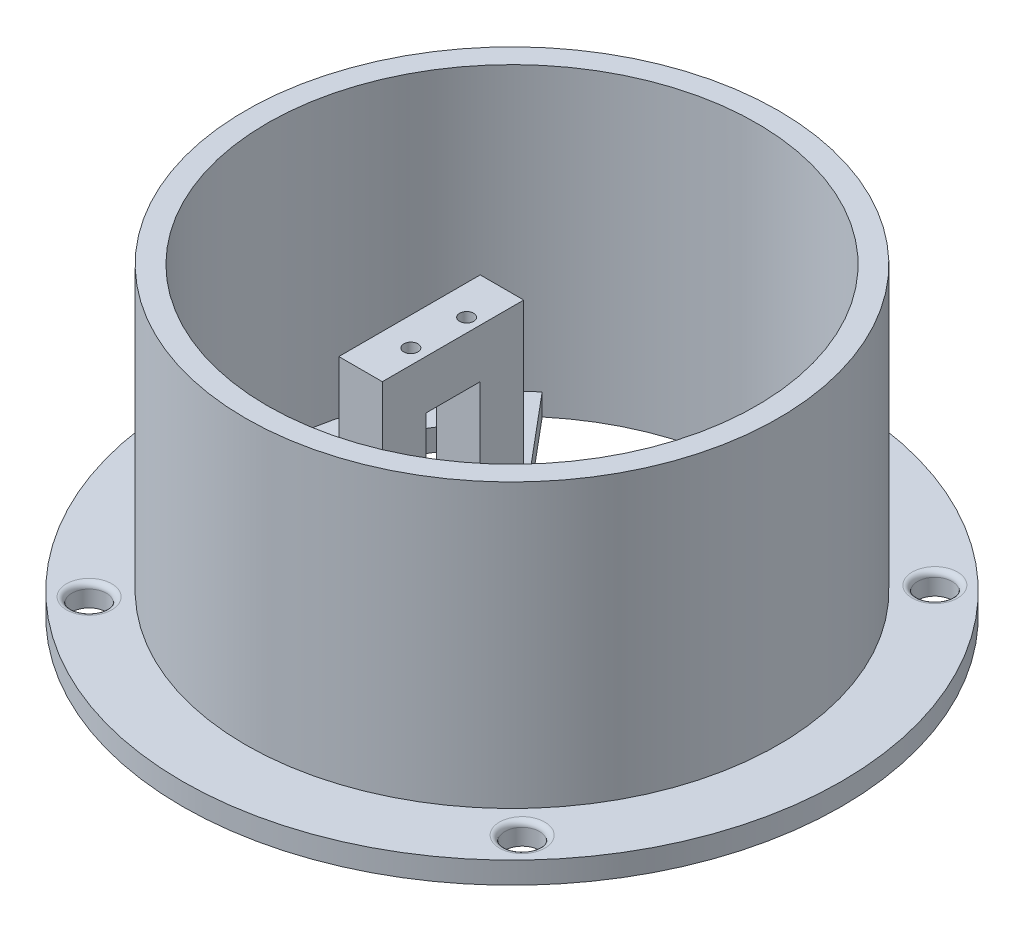
ISO-10303-21;
HEADER;
FILE_DESCRIPTION(('STEP AP214'),'2;1');
FILE_NAME('part.step','',(''),(''),'','','');
FILE_SCHEMA(('AUTOMOTIVE_DESIGN { 1 0 10303 214 1 1 1 1 }'));
ENDSEC;
DATA;
#1=APPLICATION_CONTEXT('core data for automotive mechanical design processes');
#2=APPLICATION_PROTOCOL_DEFINITION('international standard','automotive_design',2000,#1);
#3=PRODUCT_CONTEXT('',#1,'mechanical');
#4=PRODUCT('Part','Part','',(#3));
#5=PRODUCT_RELATED_PRODUCT_CATEGORY('part','',(#4));
#6=PRODUCT_DEFINITION_FORMATION('','',#4);
#7=PRODUCT_DEFINITION_CONTEXT('part definition',#1,'design');
#8=PRODUCT_DEFINITION('design','',#6,#7);
#9=PRODUCT_DEFINITION_SHAPE('','',#8);
#10=(LENGTH_UNIT() NAMED_UNIT(*) SI_UNIT(.MILLI.,.METRE.));
#11=(NAMED_UNIT(*) PLANE_ANGLE_UNIT() SI_UNIT($,.RADIAN.));
#12=(NAMED_UNIT(*) SI_UNIT($,.STERADIAN.) SOLID_ANGLE_UNIT());
#13=UNCERTAINTY_MEASURE_WITH_UNIT(LENGTH_MEASURE(1.E-05),#10,'distance_accuracy_value','');
#14=(GEOMETRIC_REPRESENTATION_CONTEXT(3) GLOBAL_UNCERTAINTY_ASSIGNED_CONTEXT((#13)) GLOBAL_UNIT_ASSIGNED_CONTEXT((#10,
#11,#12)) REPRESENTATION_CONTEXT('',''));
#15=CARTESIAN_POINT('',(0.,0.,0.));
#16=DIRECTION('',(0.,0.,1.));
#17=DIRECTION('',(1.,0.,0.));
#18=AXIS2_PLACEMENT_3D('',#15,#16,#17);
#19=CARTESIAN_POINT('',(0.,56.,0.));
#20=DIRECTION('',(0.,-1.,0.));
#21=DIRECTION('',(0.,0.,-1.));
#22=AXIS2_PLACEMENT_3D('',#19,#20,#21);
#23=CYLINDRICAL_SURFACE('',#22,45.);
#24=CARTESIAN_POINT('',(0.,56.,0.));
#25=DIRECTION('',(0.,1.,0.));
#26=DIRECTION('',(0.,0.,1.));
#27=AXIS2_PLACEMENT_3D('',#24,#25,#26);
#28=CIRCLE('',#27,45.);
#29=CARTESIAN_POINT('',(0.,56.,45.));
#30=VERTEX_POINT('',#29);
#31=EDGE_CURVE('E238',#30,#30,#28,.T.);
#32=ORIENTED_EDGE('',*,*,#31,.T.);
#33=EDGE_LOOP('',(#32));
#34=FACE_BOUND('',#33,.T.);
#35=CARTESIAN_POINT('',(0.,0.,0.));
#36=DIRECTION('',(0.,1.,0.));
#37=DIRECTION('',(0.,0.,1.));
#38=AXIS2_PLACEMENT_3D('',#35,#36,#37);
#39=CIRCLE('',#38,45.);
#40=CARTESIAN_POINT('',(42.9563294473592,0.,-13.4072279166849));
#41=VERTEX_POINT('',#40);
#42=CARTESIAN_POINT('',(-28.9254424358942,0.,-34.4719999403541));
#43=VERTEX_POINT('',#42);
#44=EDGE_CURVE('E237',#41,#43,#39,.T.);
#45=ORIENTED_EDGE('',*,*,#44,.F.);
#46=DIRECTION('',(0.,-1.,0.));
#47=VECTOR('',#46,1.);
#48=CARTESIAN_POINT('',(42.9563294473592,56.,-13.4072279166849));
#49=LINE('',#48,#47);
#50=CARTESIAN_POINT('',(42.9563294473592,38.,-13.4072279166849));
#51=VERTEX_POINT('',#50);
#52=EDGE_CURVE('E392',#41,#51,#49,.F.);
#53=ORIENTED_EDGE('',*,*,#52,.T.);
#54=CARTESIAN_POINT('',(0.,38.,0.));
#55=DIRECTION('',(0.,1.,0.));
#56=DIRECTION('',(0.,0.,1.));
#57=AXIS2_PLACEMENT_3D('',#54,#55,#56);
#58=CIRCLE('',#57,45.);
#59=CARTESIAN_POINT('',(43.1948052996357,38.,12.6177967619772));
#60=VERTEX_POINT('',#59);
#61=EDGE_CURVE('E385',#60,#51,#58,.T.);
#62=ORIENTED_EDGE('',*,*,#61,.F.);
#63=DIRECTION('',(0.,-1.,0.));
#64=VECTOR('',#63,1.);
#65=CARTESIAN_POINT('',(43.1948052996357,56.,12.6177967619772));
#66=LINE('',#65,#64);
#67=CARTESIAN_POINT('',(43.1948052996357,0.,12.6177967619772));
#68=VERTEX_POINT('',#67);
#69=EDGE_CURVE('E388',#60,#68,#66,.T.);
#70=ORIENTED_EDGE('',*,*,#69,.T.);
#71=CARTESIAN_POINT('',(-29.3245261095099,0.,34.1331535087614));
#72=VERTEX_POINT('',#71);
#73=EDGE_CURVE('E243',#72,#68,#39,.T.);
#74=ORIENTED_EDGE('',*,*,#73,.F.);
#75=DIRECTION('',(0.,-1.,0.));
#76=VECTOR('',#75,1.);
#77=CARTESIAN_POINT('',(-29.3245261095099,4.,34.1331535087614));
#78=LINE('',#77,#76);
#79=CARTESIAN_POINT('',(-29.3245261095099,4.,34.1331535087614));
#80=VERTEX_POINT('',#79);
#81=EDGE_CURVE('E377',#80,#72,#78,.T.);
#82=ORIENTED_EDGE('',*,*,#81,.F.);
#83=CARTESIAN_POINT('',(0.,4.,0.));
#84=DIRECTION('',(0.,1.,0.));
#85=DIRECTION('',(0.,0.,1.));
#86=AXIS2_PLACEMENT_3D('',#83,#84,#85);
#87=CIRCLE('',#86,45.);
#88=CARTESIAN_POINT('',(-28.9254424358942,4.,-34.4719999403541));
#89=VERTEX_POINT('',#88);
#90=EDGE_CURVE('E354',#89,#80,#87,.T.);
#91=ORIENTED_EDGE('',*,*,#90,.F.);
#92=DIRECTION('',(0.,-1.,0.));
#93=VECTOR('',#92,1.);
#94=CARTESIAN_POINT('',(-28.9254424358942,4.,-34.4719999403541));
#95=LINE('',#94,#93);
#96=EDGE_CURVE('E381',#89,#43,#95,.T.);
#97=ORIENTED_EDGE('',*,*,#96,.T.);
#98=EDGE_LOOP('',(#45,#53,#62,#70,#74,#82,#91,#97));
#99=FACE_BOUND('',#98,.T.);
#100=ADVANCED_FACE('F43',(#34,#99),#23,.F.);
#101=CARTESIAN_POINT('',(-11.25,4.,-13.4072279166849));
#102=DIRECTION('',(-0.766044443118979,0.,0.642787609686538));
#103=DIRECTION('',(0.642787609686538,0.,0.766044443118979));
#104=AXIS2_PLACEMENT_3D('',#101,#102,#103);
#105=PLANE('',#104);
#106=DIRECTION('',(-0.642787609686538,0.,-0.766044443118979));
#107=VECTOR('',#106,1.);
#108=CARTESIAN_POINT('',(-11.25,0.,-13.4072279166849));
#109=LINE('',#108,#107);
#110=CARTESIAN_POINT('',(-11.25,0.,-13.4072279166849));
#111=VERTEX_POINT('',#110);
#112=EDGE_CURVE('E350',#111,#43,#109,.T.);
#113=ORIENTED_EDGE('',*,*,#112,.T.);
#114=ORIENTED_EDGE('',*,*,#96,.F.);
#115=DIRECTION('',(-0.642787609686538,0.,-0.766044443118979));
#116=VECTOR('',#115,1.);
#117=CARTESIAN_POINT('',(-11.25,4.,-13.4072279166849));
#118=LINE('',#117,#116);
#119=CARTESIAN_POINT('',(-11.25,4.,-13.4072279166849));
#120=VERTEX_POINT('',#119);
#121=EDGE_CURVE('E351',#120,#89,#118,.T.);
#122=ORIENTED_EDGE('',*,*,#121,.F.);
#123=DIRECTION('',(0.,-1.,0.));
#124=VECTOR('',#123,1.);
#125=CARTESIAN_POINT('',(-11.25,4.,-13.4072279166849));
#126=LINE('',#125,#124);
#127=EDGE_CURVE('E361',#120,#111,#126,.T.);
#128=ORIENTED_EDGE('',*,*,#127,.T.);
#129=EDGE_LOOP('',(#113,#114,#122,#128));
#130=FACE_BOUND('',#129,.T.);
#131=ADVANCED_FACE('F552',(#130),#105,.F.);
#132=CARTESIAN_POINT('',(-11.25,4.,12.5927720833151));
#133=DIRECTION('',(-0.766044443118979,0.,-0.642787609686538));
#134=DIRECTION('',(-0.642787609686538,0.,0.766044443118979));
#135=AXIS2_PLACEMENT_3D('',#132,#133,#134);
#136=PLANE('',#135);
#137=DIRECTION('',(0.642787609686538,0.,-0.766044443118979));
#138=VECTOR('',#137,1.);
#139=CARTESIAN_POINT('',(-11.25,0.,12.5927720833151));
#140=LINE('',#139,#138);
#141=CARTESIAN_POINT('',(-11.25,0.,12.5927720833151));
#142=VERTEX_POINT('',#141);
#143=EDGE_CURVE('E365',#72,#142,#140,.T.);
#144=ORIENTED_EDGE('',*,*,#143,.T.);
#145=DIRECTION('',(0.,-1.,0.));
#146=VECTOR('',#145,1.);
#147=CARTESIAN_POINT('',(-11.25,4.,12.5927720833151));
#148=LINE('',#147,#146);
#149=CARTESIAN_POINT('',(-11.25,4.,12.5927720833151));
#150=VERTEX_POINT('',#149);
#151=EDGE_CURVE('E373',#150,#142,#148,.T.);
#152=ORIENTED_EDGE('',*,*,#151,.F.);
#153=DIRECTION('',(0.642787609686538,0.,-0.766044443118979));
#154=VECTOR('',#153,1.);
#155=CARTESIAN_POINT('',(-11.25,4.,12.5927720833151));
#156=LINE('',#155,#154);
#157=EDGE_CURVE('E358',#80,#150,#156,.T.);
#158=ORIENTED_EDGE('',*,*,#157,.F.);
#159=ORIENTED_EDGE('',*,*,#81,.T.);
#160=EDGE_LOOP('',(#144,#152,#158,#159));
#161=FACE_BOUND('',#160,.T.);
#162=ADVANCED_FACE('F546',(#161),#136,.F.);
#163=CARTESIAN_POINT('',(-11.25,4.,-13.4072279166849));
#164=DIRECTION('',(-1.,0.,0.));
#165=DIRECTION('',(0.,0.,1.));
#166=AXIS2_PLACEMENT_3D('',#163,#164,#165);
#167=PLANE('',#166);
#168=DIRECTION('',(0.,0.,1.));
#169=VECTOR('',#168,1.);
#170=CARTESIAN_POINT('',(-11.25,29.,4.59277208331509));
#171=LINE('',#170,#169);
#172=CARTESIAN_POINT('',(-11.25,29.,-5.40722791668491));
#173=VERTEX_POINT('',#172);
#174=CARTESIAN_POINT('',(-11.25,29.,4.59277208331509));
#175=VERTEX_POINT('',#174);
#176=EDGE_CURVE('E280',#173,#175,#171,.T.);
#177=ORIENTED_EDGE('',*,*,#176,.F.);
#178=DIRECTION('',(0.,1.,0.));
#179=VECTOR('',#178,1.);
#180=CARTESIAN_POINT('',(-11.25,29.,-5.40722791668491));
#181=LINE('',#180,#179);
#182=CARTESIAN_POINT('',(-11.25,5.,-5.40722791668491));
#183=VERTEX_POINT('',#182);
#184=EDGE_CURVE('E277',#183,#173,#181,.T.);
#185=ORIENTED_EDGE('',*,*,#184,.F.);
#186=DIRECTION('',(0.,0.,-1.));
#187=VECTOR('',#186,1.);
#188=CARTESIAN_POINT('',(-11.25,5.,4.59277208331509));
#189=LINE('',#188,#187);
#190=CARTESIAN_POINT('',(-11.25,5.,4.59277208331509));
#191=VERTEX_POINT('',#190);
#192=EDGE_CURVE('E288',#191,#183,#189,.T.);
#193=ORIENTED_EDGE('',*,*,#192,.F.);
#194=DIRECTION('',(0.,-1.,0.));
#195=VECTOR('',#194,1.);
#196=CARTESIAN_POINT('',(-11.25,29.,4.59277208331509));
#197=LINE('',#196,#195);
#198=EDGE_CURVE('E284',#175,#191,#197,.T.);
#199=ORIENTED_EDGE('',*,*,#198,.F.);
#200=EDGE_LOOP('',(#177,#185,#193,#199));
#201=FACE_BOUND('',#200,.T.);
#202=DIRECTION('',(0.,0.,-1.));
#203=VECTOR('',#202,1.);
#204=CARTESIAN_POINT('',(-11.25,0.,-13.4072279166849));
#205=LINE('',#204,#203);
#206=EDGE_CURVE('E355',#142,#111,#205,.T.);
#207=ORIENTED_EDGE('',*,*,#206,.T.);
#208=ORIENTED_EDGE('',*,*,#127,.F.);
#209=DIRECTION('',(0.,-1.,0.));
#210=VECTOR('',#209,1.);
#211=CARTESIAN_POINT('',(-11.25,38.,-13.4072279166849));
#212=LINE('',#211,#210);
#213=CARTESIAN_POINT('',(-11.25,38.,-13.4072279166849));
#214=VERTEX_POINT('',#213);
#215=EDGE_CURVE('E324',#214,#120,#212,.T.);
#216=ORIENTED_EDGE('',*,*,#215,.F.);
#217=DIRECTION('',(0.,0.,-1.));
#218=VECTOR('',#217,1.);
#219=CARTESIAN_POINT('',(-11.25,38.,-13.4072279166849));
#220=LINE('',#219,#218);
#221=CARTESIAN_POINT('',(-11.25,38.,12.5927720833151));
#222=VERTEX_POINT('',#221);
#223=EDGE_CURVE('E321',#222,#214,#220,.T.);
#224=ORIENTED_EDGE('',*,*,#223,.F.);
#225=DIRECTION('',(0.,-1.,0.));
#226=VECTOR('',#225,1.);
#227=CARTESIAN_POINT('',(-11.25,38.,12.5927720833151));
#228=LINE('',#227,#226);
#229=EDGE_CURVE('E338',#222,#150,#228,.T.);
#230=ORIENTED_EDGE('',*,*,#229,.T.);
#231=ORIENTED_EDGE('',*,*,#151,.T.);
#232=EDGE_LOOP('',(#207,#208,#216,#224,#230,#231));
#233=FACE_BOUND('',#232,.T.);
#234=ADVANCED_FACE('F556',(#201,#233),#167,.F.);
#235=CARTESIAN_POINT('',(0.,4.,0.));
#236=DIRECTION('',(0.,1.,0.));
#237=DIRECTION('',(0.,0.,1.));
#238=AXIS2_PLACEMENT_3D('',#235,#236,#237);
#239=PLANE('',#238);
#240=DIRECTION('',(-0.64064590653356,0.,-0.767836455530599));
#241=VECTOR('',#240,1.);
#242=CARTESIAN_POINT('',(-24.25,4.,-17.1368531610951));
#243=LINE('',#242,#241);
#244=CARTESIAN_POINT('',(-24.25,4.,-17.1368531610951));
#245=VERTEX_POINT('',#244);
#246=CARTESIAN_POINT('',(-29.4776705973138,4.,-23.4023986382247));
#247=VERTEX_POINT('',#246);
#248=EDGE_CURVE('E59',#245,#247,#243,.T.);
#249=ORIENTED_EDGE('',*,*,#248,.F.);
#250=DIRECTION('',(0.,0.,-1.));
#251=VECTOR('',#250,1.);
#252=CARTESIAN_POINT('',(-24.25,4.,-17.1368531610951));
#253=LINE('',#252,#251);
#254=CARTESIAN_POINT('',(-24.25,4.,15.0431468389049));
#255=VERTEX_POINT('',#254);
#256=EDGE_CURVE('E196',#255,#245,#253,.T.);
#257=ORIENTED_EDGE('',*,*,#256,.F.);
#258=DIRECTION('',(0.64064590653356,0.,-0.767836455530599));
#259=VECTOR('',#258,1.);
#260=CARTESIAN_POINT('',(-24.25,4.,15.0431468389049));
#261=LINE('',#260,#259);
#262=CARTESIAN_POINT('',(-29.4776705973138,4.,21.3086923160346));
#263=VERTEX_POINT('',#262);
#264=EDGE_CURVE('E178',#263,#255,#261,.T.);
#265=ORIENTED_EDGE('',*,*,#264,.F.);
#266=CARTESIAN_POINT('',(-7.11214499325518,4.,-1.04685316109506));
#267=DIRECTION('',(0.,1.,0.));
#268=DIRECTION('',(0.,0.,1.));
#269=AXIS2_PLACEMENT_3D('',#266,#267,#268);
#270=CIRCLE('',#269,31.6225734108693);
#271=EDGE_CURVE('E188',#247,#263,#270,.T.);
#272=ORIENTED_EDGE('',*,*,#271,.F.);
#273=EDGE_LOOP('',(#249,#257,#265,#272));
#274=FACE_BOUND('',#273,.T.);
#275=DIRECTION('',(-1.,0.,0.));
#276=VECTOR('',#275,1.);
#277=CARTESIAN_POINT('',(-19.25,4.,-13.4072279166849));
#278=LINE('',#277,#276);
#279=CARTESIAN_POINT('',(-19.25,4.,-13.4072279166849));
#280=VERTEX_POINT('',#279);
#281=EDGE_CURVE('E309',#120,#280,#278,.T.);
#282=ORIENTED_EDGE('',*,*,#281,.F.);
#283=ORIENTED_EDGE('',*,*,#121,.T.);
#284=ORIENTED_EDGE('',*,*,#90,.T.);
#285=ORIENTED_EDGE('',*,*,#157,.T.);
#286=DIRECTION('',(1.,0.,0.));
#287=VECTOR('',#286,1.);
#288=CARTESIAN_POINT('',(-11.25,4.,12.5927720833151));
#289=LINE('',#288,#287);
#290=CARTESIAN_POINT('',(-19.25,4.,12.5927720833151));
#291=VERTEX_POINT('',#290);
#292=EDGE_CURVE('E315',#291,#150,#289,.T.);
#293=ORIENTED_EDGE('',*,*,#292,.F.);
#294=DIRECTION('',(0.,0.,1.));
#295=VECTOR('',#294,1.);
#296=CARTESIAN_POINT('',(-19.25,4.,12.5927720833151));
#297=LINE('',#296,#295);
#298=EDGE_CURVE('E328',#280,#291,#297,.T.);
#299=ORIENTED_EDGE('',*,*,#298,.F.);
#300=EDGE_LOOP('',(#282,#283,#284,#285,#293,#299));
#301=FACE_BOUND('',#300,.T.);
#302=ADVANCED_FACE('F193',(#274,#301),#239,.T.);
#303=CARTESIAN_POINT('',(0.,0.,0.));
#304=DIRECTION('',(0.,1.,0.));
#305=DIRECTION('',(0.,0.,1.));
#306=AXIS2_PLACEMENT_3D('',#303,#304,#305);
#307=PLANE('',#306);
#308=CARTESIAN_POINT('',(-37.9459720978994,0.,39.8133545628278));
#309=DIRECTION('',(0.,1.,0.));
#310=DIRECTION('',(0.,0.,1.));
#311=AXIS2_PLACEMENT_3D('',#308,#309,#310);
#312=CIRCLE('',#311,3.1645);
#313=CARTESIAN_POINT('',(-37.9459720978994,0.,42.9778545628278));
#314=VERTEX_POINT('',#313);
#315=EDGE_CURVE('E476',#314,#314,#312,.T.);
#316=ORIENTED_EDGE('',*,*,#315,.T.);
#317=EDGE_LOOP('',(#316));
#318=FACE_BOUND('',#317,.T.);
#319=CARTESIAN_POINT('',(39.8140279021006,0.,37.9452656099645));
#320=DIRECTION('',(0.,1.,0.));
#321=DIRECTION('',(0.,0.,1.));
#322=AXIS2_PLACEMENT_3D('',#319,#320,#321);
#323=CIRCLE('',#322,3.1645);
#324=CARTESIAN_POINT('',(39.8140279021006,0.,41.1097656099645));
#325=VERTEX_POINT('',#324);
#326=EDGE_CURVE('E480',#325,#325,#323,.T.);
#327=ORIENTED_EDGE('',*,*,#326,.T.);
#328=EDGE_LOOP('',(#327));
#329=FACE_BOUND('',#328,.T.);
#330=CARTESIAN_POINT('',(37.9445243144637,0.,-39.8147343900355));
#331=DIRECTION('',(0.,1.,0.));
#332=DIRECTION('',(0.,0.,1.));
#333=AXIS2_PLACEMENT_3D('',#330,#331,#332);
#334=CIRCLE('',#333,3.1645);
#335=CARTESIAN_POINT('',(37.9445243144637,0.,-36.6502343900355));
#336=VERTEX_POINT('',#335);
#337=EDGE_CURVE('E470',#336,#336,#334,.T.);
#338=ORIENTED_EDGE('',*,*,#337,.T.);
#339=EDGE_LOOP('',(#338));
#340=FACE_BOUND('',#339,.T.);
#341=CARTESIAN_POINT('',(-39.8154756855363,0.,-37.9466454371722));
#342=DIRECTION('',(0.,1.,0.));
#343=DIRECTION('',(0.,0.,1.));
#344=AXIS2_PLACEMENT_3D('',#341,#342,#343);
#345=CIRCLE('',#344,3.1645);
#346=CARTESIAN_POINT('',(-39.8154756855363,0.,-34.7821454371722));
#347=VERTEX_POINT('',#346);
#348=EDGE_CURVE('E463',#347,#347,#345,.T.);
#349=ORIENTED_EDGE('',*,*,#348,.T.);
#350=EDGE_LOOP('',(#349));
#351=FACE_BOUND('',#350,.T.);
#352=DIRECTION('',(0.,0.,-1.));
#353=VECTOR('',#352,1.);
#354=CARTESIAN_POINT('',(-24.25,0.,0.));
#355=LINE('',#354,#353);
#356=CARTESIAN_POINT('',(-24.25,0.,15.0431468389049));
#357=VERTEX_POINT('',#356);
#358=CARTESIAN_POINT('',(-24.25,0.,-17.1368531610951));
#359=VERTEX_POINT('',#358);
#360=EDGE_CURVE('E401',#357,#359,#355,.T.);
#361=ORIENTED_EDGE('',*,*,#360,.T.);
#362=DIRECTION('',(-0.64064590653356,0.,-0.767836455530599));
#363=VECTOR('',#362,1.);
#364=CARTESIAN_POINT('',(-5.86732953418706,0.,4.89541831634303));
#365=LINE('',#364,#363);
#366=CARTESIAN_POINT('',(-29.4776705973138,0.,-23.4023986382247));
#367=VERTEX_POINT('',#366);
#368=EDGE_CURVE('E405',#359,#367,#365,.T.);
#369=ORIENTED_EDGE('',*,*,#368,.T.);
#370=CARTESIAN_POINT('',(-7.11214499325518,0.,-1.04685316109506));
#371=DIRECTION('',(0.,1.,0.));
#372=DIRECTION('',(0.,0.,1.));
#373=AXIS2_PLACEMENT_3D('',#370,#371,#372);
#374=CIRCLE('',#373,31.6225734108693);
#375=CARTESIAN_POINT('',(-29.4776705973138,0.,21.3086923160346));
#376=VERTEX_POINT('',#375);
#377=EDGE_CURVE('E396',#367,#376,#374,.T.);
#378=ORIENTED_EDGE('',*,*,#377,.T.);
#379=DIRECTION('',(0.64064590653356,0.,-0.767836455530599));
#380=VECTOR('',#379,1.);
#381=CARTESIAN_POINT('',(-6.89724729552448,0.,-5.7547322927953));
#382=LINE('',#381,#380);
#383=EDGE_CURVE('E181',#376,#357,#382,.T.);
#384=ORIENTED_EDGE('',*,*,#383,.T.);
#385=EDGE_LOOP('',(#361,#369,#378,#384));
#386=FACE_BOUND('',#385,.T.);
#387=ORIENTED_EDGE('',*,*,#73,.T.);
#388=DIRECTION('',(1.,0.,0.));
#389=VECTOR('',#388,1.);
#390=CARTESIAN_POINT('',(31.75,0.,12.6177967619772));
#391=LINE('',#390,#389);
#392=CARTESIAN_POINT('',(31.75,0.,12.6177967619772));
#393=VERTEX_POINT('',#392);
#394=EDGE_CURVE('E215',#393,#68,#391,.T.);
#395=ORIENTED_EDGE('',*,*,#394,.F.);
#396=DIRECTION('',(0.,0.,1.));
#397=VECTOR('',#396,1.);
#398=CARTESIAN_POINT('',(31.75,0.,-13.4072279166849));
#399=LINE('',#398,#397);
#400=CARTESIAN_POINT('',(31.75,0.,-13.4072279166849));
#401=VERTEX_POINT('',#400);
#402=EDGE_CURVE('E225',#401,#393,#399,.T.);
#403=ORIENTED_EDGE('',*,*,#402,.F.);
#404=DIRECTION('',(-1.,0.,0.));
#405=VECTOR('',#404,1.);
#406=CARTESIAN_POINT('',(31.75,0.,-13.4072279166849));
#407=LINE('',#406,#405);
#408=EDGE_CURVE('E206',#41,#401,#407,.T.);
#409=ORIENTED_EDGE('',*,*,#408,.F.);
#410=ORIENTED_EDGE('',*,*,#44,.T.);
#411=ORIENTED_EDGE('',*,*,#112,.F.);
#412=ORIENTED_EDGE('',*,*,#206,.F.);
#413=ORIENTED_EDGE('',*,*,#143,.F.);
#414=EDGE_LOOP('',(#387,#395,#403,#409,#410,#411,#412,#413));
#415=FACE_BOUND('',#414,.T.);
#416=CARTESIAN_POINT('',(0.,0.,0.));
#417=DIRECTION('',(0.,1.,0.));
#418=DIRECTION('',(0.,0.,1.));
#419=AXIS2_PLACEMENT_3D('',#416,#417,#418);
#420=CIRCLE('',#419,60.625);
#421=CARTESIAN_POINT('',(0.,0.,60.625));
#422=VERTEX_POINT('',#421);
#423=EDGE_CURVE('E462',#422,#422,#420,.T.);
#424=ORIENTED_EDGE('',*,*,#423,.F.);
#425=EDGE_LOOP('',(#424));
#426=FACE_BOUND('',#425,.T.);
#427=ADVANCED_FACE('F539',(#318,#329,#340,#351,#386,#415,#426),#307,.F.);
#428=CARTESIAN_POINT('',(-19.25,38.,-13.4072279166849));
#429=DIRECTION('',(0.,0.,1.));
#430=DIRECTION('',(1.,0.,0.));
#431=AXIS2_PLACEMENT_3D('',#428,#429,#430);
#432=PLANE('',#431);
#433=ORIENTED_EDGE('',*,*,#281,.T.);
#434=DIRECTION('',(0.,-1.,0.));
#435=VECTOR('',#434,1.);
#436=CARTESIAN_POINT('',(-19.25,38.,-13.4072279166849));
#437=LINE('',#436,#435);
#438=CARTESIAN_POINT('',(-19.25,38.,-13.4072279166849));
#439=VERTEX_POINT('',#438);
#440=EDGE_CURVE('E346',#439,#280,#437,.T.);
#441=ORIENTED_EDGE('',*,*,#440,.F.);
#442=DIRECTION('',(-1.,0.,0.));
#443=VECTOR('',#442,1.);
#444=CARTESIAN_POINT('',(-19.25,38.,-13.4072279166849));
#445=LINE('',#444,#443);
#446=EDGE_CURVE('E310',#214,#439,#445,.T.);
#447=ORIENTED_EDGE('',*,*,#446,.F.);
#448=ORIENTED_EDGE('',*,*,#215,.T.);
#449=EDGE_LOOP('',(#433,#441,#447,#448));
#450=FACE_BOUND('',#449,.T.);
#451=ADVANCED_FACE('F569',(#450),#432,.F.);
#452=CARTESIAN_POINT('',(-19.25,38.,12.5927720833151));
#453=DIRECTION('',(1.,0.,0.));
#454=DIRECTION('',(0.,0.,-1.));
#455=AXIS2_PLACEMENT_3D('',#452,#453,#454);
#456=PLANE('',#455);
#457=DIRECTION('',(0.,0.,1.));
#458=VECTOR('',#457,1.);
#459=CARTESIAN_POINT('',(-19.25,5.,4.59277208331509));
#460=LINE('',#459,#458);
#461=CARTESIAN_POINT('',(-19.25,5.,-5.40722791668491));
#462=VERTEX_POINT('',#461);
#463=CARTESIAN_POINT('',(-19.25,5.,4.59277208331509));
#464=VERTEX_POINT('',#463);
#465=EDGE_CURVE('E269',#462,#464,#460,.T.);
#466=ORIENTED_EDGE('',*,*,#465,.F.);
#467=DIRECTION('',(0.,-1.,0.));
#468=VECTOR('',#467,1.);
#469=CARTESIAN_POINT('',(-19.25,29.,-5.40722791668491));
#470=LINE('',#469,#468);
#471=CARTESIAN_POINT('',(-19.25,29.,-5.40722791668491));
#472=VERTEX_POINT('',#471);
#473=EDGE_CURVE('E273',#472,#462,#470,.T.);
#474=ORIENTED_EDGE('',*,*,#473,.F.);
#475=DIRECTION('',(0.,0.,-1.));
#476=VECTOR('',#475,1.);
#477=CARTESIAN_POINT('',(-19.25,29.,4.59277208331509));
#478=LINE('',#477,#476);
#479=CARTESIAN_POINT('',(-19.25,29.,4.59277208331509));
#480=VERTEX_POINT('',#479);
#481=EDGE_CURVE('E296',#480,#472,#478,.T.);
#482=ORIENTED_EDGE('',*,*,#481,.F.);
#483=DIRECTION('',(0.,1.,0.));
#484=VECTOR('',#483,1.);
#485=CARTESIAN_POINT('',(-19.25,29.,4.59277208331509));
#486=LINE('',#485,#484);
#487=EDGE_CURVE('E255',#464,#480,#486,.T.);
#488=ORIENTED_EDGE('',*,*,#487,.F.);
#489=EDGE_LOOP('',(#466,#474,#482,#488));
#490=FACE_BOUND('',#489,.T.);
#491=ORIENTED_EDGE('',*,*,#298,.T.);
#492=DIRECTION('',(0.,-1.,0.));
#493=VECTOR('',#492,1.);
#494=CARTESIAN_POINT('',(-19.25,38.,12.5927720833151));
#495=LINE('',#494,#493);
#496=CARTESIAN_POINT('',(-19.25,38.,12.5927720833151));
#497=VERTEX_POINT('',#496);
#498=EDGE_CURVE('E342',#497,#291,#495,.T.);
#499=ORIENTED_EDGE('',*,*,#498,.F.);
#500=DIRECTION('',(0.,0.,1.));
#501=VECTOR('',#500,1.);
#502=CARTESIAN_POINT('',(-19.25,38.,12.5927720833151));
#503=LINE('',#502,#501);
#504=EDGE_CURVE('E314',#439,#497,#503,.T.);
#505=ORIENTED_EDGE('',*,*,#504,.F.);
#506=ORIENTED_EDGE('',*,*,#440,.T.);
#507=EDGE_LOOP('',(#491,#499,#505,#506));
#508=FACE_BOUND('',#507,.T.);
#509=ADVANCED_FACE('F565',(#490,#508),#456,.F.);
#510=CARTESIAN_POINT('',(-11.25,38.,12.5927720833151));
#511=DIRECTION('',(0.,0.,-1.));
#512=DIRECTION('',(-1.,0.,0.));
#513=AXIS2_PLACEMENT_3D('',#510,#511,#512);
#514=PLANE('',#513);
#515=ORIENTED_EDGE('',*,*,#292,.T.);
#516=ORIENTED_EDGE('',*,*,#229,.F.);
#517=DIRECTION('',(1.,0.,0.));
#518=VECTOR('',#517,1.);
#519=CARTESIAN_POINT('',(-11.25,38.,12.5927720833151));
#520=LINE('',#519,#518);
#521=EDGE_CURVE('E318',#497,#222,#520,.T.);
#522=ORIENTED_EDGE('',*,*,#521,.F.);
#523=ORIENTED_EDGE('',*,*,#498,.T.);
#524=EDGE_LOOP('',(#515,#516,#522,#523));
#525=FACE_BOUND('',#524,.T.);
#526=ADVANCED_FACE('F562',(#525),#514,.F.);
#527=CARTESIAN_POINT('',(0.,38.,0.));
#528=DIRECTION('',(0.,-1.,0.));
#529=DIRECTION('',(0.,0.,-1.));
#530=AXIS2_PLACEMENT_3D('',#527,#528,#529);
#531=PLANE('',#530);
#532=CARTESIAN_POINT('',(-13.75,38.,-5.40722791668491));
#533=DIRECTION('',(0.,1.,0.));
#534=DIRECTION('',(0.,0.,1.));
#535=AXIS2_PLACEMENT_3D('',#532,#533,#534);
#536=CIRCLE('',#535,1.3);
#537=CARTESIAN_POINT('',(-13.75,38.,-4.10722791668491));
#538=VERTEX_POINT('',#537);
#539=EDGE_CURVE('E256',#538,#538,#536,.T.);
#540=ORIENTED_EDGE('',*,*,#539,.F.);
#541=EDGE_LOOP('',(#540));
#542=FACE_BOUND('',#541,.T.);
#543=CARTESIAN_POINT('',(-14.0092614160017,38.,4.59277208331509));
#544=DIRECTION('',(0.,1.,0.));
#545=DIRECTION('',(0.,0.,1.));
#546=AXIS2_PLACEMENT_3D('',#543,#544,#545);
#547=CIRCLE('',#546,1.3);
#548=CARTESIAN_POINT('',(-14.0092614160017,38.,5.89277208331509));
#549=VERTEX_POINT('',#548);
#550=EDGE_CURVE('E250',#549,#549,#547,.T.);
#551=ORIENTED_EDGE('',*,*,#550,.F.);
#552=EDGE_LOOP('',(#551));
#553=FACE_BOUND('',#552,.T.);
#554=ORIENTED_EDGE('',*,*,#446,.T.);
#555=ORIENTED_EDGE('',*,*,#504,.T.);
#556=ORIENTED_EDGE('',*,*,#521,.T.);
#557=ORIENTED_EDGE('',*,*,#223,.T.);
#558=EDGE_LOOP('',(#554,#555,#556,#557));
#559=FACE_BOUND('',#558,.T.);
#560=ADVANCED_FACE('F571',(#542,#553,#559),#531,.F.);
#561=CARTESIAN_POINT('',(-45.001,29.,-5.4072279166849));
#562=DIRECTION('',(0.,0.,-1.));
#563=DIRECTION('',(-1.,0.,0.));
#564=AXIS2_PLACEMENT_3D('',#561,#562,#563);
#565=PLANE('',#564);
#566=ORIENTED_EDGE('',*,*,#473,.T.);
#567=DIRECTION('',(1.,0.,0.));
#568=VECTOR('',#567,1.);
#569=CARTESIAN_POINT('',(-45.001,5.,-5.40722791668491));
#570=LINE('',#569,#568);
#571=EDGE_CURVE('E293',#462,#183,#570,.T.);
#572=ORIENTED_EDGE('',*,*,#571,.T.);
#573=ORIENTED_EDGE('',*,*,#184,.T.);
#574=DIRECTION('',(1.,0.,0.));
#575=VECTOR('',#574,1.);
#576=CARTESIAN_POINT('',(-45.001,29.,-5.4072279166849));
#577=LINE('',#576,#575);
#578=EDGE_CURVE('E292',#472,#173,#577,.T.);
#579=ORIENTED_EDGE('',*,*,#578,.F.);
#580=EDGE_LOOP('',(#566,#572,#573,#579));
#581=FACE_BOUND('',#580,.T.);
#582=ADVANCED_FACE('F573',(#581),#565,.F.);
#583=CARTESIAN_POINT('',(-45.001,5.,4.59277208331509));
#584=DIRECTION('',(0.,-1.,0.));
#585=DIRECTION('',(0.,0.,-1.));
#586=AXIS2_PLACEMENT_3D('',#583,#584,#585);
#587=PLANE('',#586);
#588=ORIENTED_EDGE('',*,*,#465,.T.);
#589=DIRECTION('',(1.,0.,0.));
#590=VECTOR('',#589,1.);
#591=CARTESIAN_POINT('',(-45.001,5.,4.59277208331509));
#592=LINE('',#591,#590);
#593=EDGE_CURVE('E297',#464,#191,#592,.T.);
#594=ORIENTED_EDGE('',*,*,#593,.T.);
#595=ORIENTED_EDGE('',*,*,#192,.T.);
#596=ORIENTED_EDGE('',*,*,#571,.F.);
#597=EDGE_LOOP('',(#588,#594,#595,#596));
#598=FACE_BOUND('',#597,.T.);
#599=ADVANCED_FACE('F580',(#598),#587,.F.);
#600=CARTESIAN_POINT('',(-45.001,29.,4.59277208331509));
#601=DIRECTION('',(0.,0.,1.));
#602=DIRECTION('',(1.,0.,0.));
#603=AXIS2_PLACEMENT_3D('',#600,#601,#602);
#604=PLANE('',#603);
#605=ORIENTED_EDGE('',*,*,#487,.T.);
#606=DIRECTION('',(1.,0.,0.));
#607=VECTOR('',#606,1.);
#608=CARTESIAN_POINT('',(-45.001,29.,4.59277208331509));
#609=LINE('',#608,#607);
#610=EDGE_CURVE('E300',#480,#175,#609,.T.);
#611=ORIENTED_EDGE('',*,*,#610,.T.);
#612=ORIENTED_EDGE('',*,*,#198,.T.);
#613=ORIENTED_EDGE('',*,*,#593,.F.);
#614=EDGE_LOOP('',(#605,#611,#612,#613));
#615=FACE_BOUND('',#614,.T.);
#616=ADVANCED_FACE('F621',(#615),#604,.F.);
#617=CARTESIAN_POINT('',(-45.001,29.,4.59277208331509));
#618=DIRECTION('',(0.,1.,0.));
#619=DIRECTION('',(0.,0.,1.));
#620=AXIS2_PLACEMENT_3D('',#617,#618,#619);
#621=PLANE('',#620);
#622=ORIENTED_EDGE('',*,*,#481,.T.);
#623=ORIENTED_EDGE('',*,*,#578,.T.);
#624=ORIENTED_EDGE('',*,*,#176,.T.);
#625=ORIENTED_EDGE('',*,*,#610,.F.);
#626=EDGE_LOOP('',(#622,#623,#624,#625));
#627=FACE_BOUND('',#626,.T.);
#628=ADVANCED_FACE('F617',(#627),#621,.F.);
#629=CARTESIAN_POINT('',(-14.0092614160017,31.,4.59277208331509));
#630=DIRECTION('',(0.,1.,0.));
#631=DIRECTION('',(0.,0.,1.));
#632=AXIS2_PLACEMENT_3D('',#629,#630,#631);
#633=CYLINDRICAL_SURFACE('',#632,1.3);
#634=CARTESIAN_POINT('',(-14.0092614160017,31.,4.59277208331509));
#635=DIRECTION('',(0.,1.,0.));
#636=DIRECTION('',(0.,0.,1.));
#637=AXIS2_PLACEMENT_3D('',#634,#635,#636);
#638=CIRCLE('',#637,1.3);
#639=CARTESIAN_POINT('',(-14.0092614160017,31.,5.89277208331509));
#640=VERTEX_POINT('',#639);
#641=EDGE_CURVE('E260',#640,#640,#638,.T.);
#642=ORIENTED_EDGE('',*,*,#641,.F.);
#643=EDGE_LOOP('',(#642));
#644=FACE_BOUND('',#643,.T.);
#645=ORIENTED_EDGE('',*,*,#550,.T.);
#646=EDGE_LOOP('',(#645));
#647=FACE_BOUND('',#646,.T.);
#648=ADVANCED_FACE('F613',(#644,#647),#633,.F.);
#649=CARTESIAN_POINT('',(-14.0092614160017,31.,4.59277208331509));
#650=DIRECTION('',(0.,1.,0.));
#651=DIRECTION('',(0.,0.,1.));
#652=AXIS2_PLACEMENT_3D('',#649,#650,#651);
#653=PLANE('',#652);
#654=ORIENTED_EDGE('',*,*,#641,.T.);
#655=EDGE_LOOP('',(#654));
#656=FACE_BOUND('',#655,.T.);
#657=ADVANCED_FACE('F609',(#656),#653,.T.);
#658=CARTESIAN_POINT('',(-13.75,31.,-5.40722791668491));
#659=DIRECTION('',(0.,1.,0.));
#660=DIRECTION('',(0.,0.,1.));
#661=AXIS2_PLACEMENT_3D('',#658,#659,#660);
#662=CYLINDRICAL_SURFACE('',#661,1.3);
#663=CARTESIAN_POINT('',(-13.75,31.,-5.40722791668491));
#664=DIRECTION('',(0.,1.,0.));
#665=DIRECTION('',(0.,0.,1.));
#666=AXIS2_PLACEMENT_3D('',#663,#664,#665);
#667=CIRCLE('',#666,1.3);
#668=CARTESIAN_POINT('',(-13.75,31.,-4.10722791668491));
#669=VERTEX_POINT('',#668);
#670=EDGE_CURVE('E251',#669,#669,#667,.T.);
#671=ORIENTED_EDGE('',*,*,#670,.F.);
#672=EDGE_LOOP('',(#671));
#673=FACE_BOUND('',#672,.T.);
#674=ORIENTED_EDGE('',*,*,#539,.T.);
#675=EDGE_LOOP('',(#674));
#676=FACE_BOUND('',#675,.T.);
#677=ADVANCED_FACE('F605',(#673,#676),#662,.F.);
#678=CARTESIAN_POINT('',(-13.75,31.,-5.40722791668491));
#679=DIRECTION('',(0.,1.,0.));
#680=DIRECTION('',(0.,0.,1.));
#681=AXIS2_PLACEMENT_3D('',#678,#679,#680);
#682=PLANE('',#681);
#683=ORIENTED_EDGE('',*,*,#670,.T.);
#684=EDGE_LOOP('',(#683));
#685=FACE_BOUND('',#684,.T.);
#686=ADVANCED_FACE('F599',(#685),#682,.T.);
#687=CARTESIAN_POINT('',(0.,56.,0.));
#688=DIRECTION('',(0.,1.,0.));
#689=DIRECTION('',(0.,0.,1.));
#690=AXIS2_PLACEMENT_3D('',#687,#688,#689);
#691=PLANE('',#690);
#692=CARTESIAN_POINT('',(0.,56.,0.));
#693=DIRECTION('',(0.,1.,0.));
#694=DIRECTION('',(0.,0.,1.));
#695=AXIS2_PLACEMENT_3D('',#692,#693,#694);
#696=CIRCLE('',#695,49.);
#697=CARTESIAN_POINT('',(0.,56.,49.));
#698=VERTEX_POINT('',#697);
#699=EDGE_CURVE('E242',#698,#698,#696,.T.);
#700=ORIENTED_EDGE('',*,*,#699,.T.);
#701=EDGE_LOOP('',(#700));
#702=FACE_BOUND('',#701,.T.);
#703=ORIENTED_EDGE('',*,*,#31,.F.);
#704=EDGE_LOOP('',(#703));
#705=FACE_BOUND('',#704,.T.);
#706=ADVANCED_FACE('F596',(#702,#705),#691,.T.);
#707=CARTESIAN_POINT('',(0.,56.,0.));
#708=DIRECTION('',(0.,-1.,0.));
#709=DIRECTION('',(0.,0.,-1.));
#710=AXIS2_PLACEMENT_3D('',#707,#708,#709);
#711=CYLINDRICAL_SURFACE('',#710,49.);
#712=CARTESIAN_POINT('',(0.,4.,0.));
#713=DIRECTION('',(0.,1.,0.));
#714=DIRECTION('',(0.,0.,1.));
#715=AXIS2_PLACEMENT_3D('',#712,#713,#714);
#716=CIRCLE('',#715,49.);
#717=CARTESIAN_POINT('',(0.,4.,49.));
#718=VERTEX_POINT('',#717);
#719=EDGE_CURVE('E459',#718,#718,#716,.T.);
#720=ORIENTED_EDGE('',*,*,#719,.T.);
#721=EDGE_LOOP('',(#720));
#722=FACE_BOUND('',#721,.T.);
#723=ORIENTED_EDGE('',*,*,#699,.F.);
#724=EDGE_LOOP('',(#723));
#725=FACE_BOUND('',#724,.T.);
#726=ADVANCED_FACE('F517',(#722,#725),#711,.T.);
#727=CARTESIAN_POINT('',(0.,38.,0.));
#728=DIRECTION('',(0.,1.,0.));
#729=DIRECTION('',(0.,0.,1.));
#730=AXIS2_PLACEMENT_3D('',#727,#728,#729);
#731=PLANE('',#730);
#732=CARTESIAN_POINT('',(34.25,38.,-5.40722791668493));
#733=DIRECTION('',(0.,1.,0.));
#734=DIRECTION('',(0.,0.,1.));
#735=AXIS2_PLACEMENT_3D('',#732,#733,#734);
#736=CIRCLE('',#735,1.3);
#737=CARTESIAN_POINT('',(34.25,38.,-4.10722791668492));
#738=VERTEX_POINT('',#737);
#739=EDGE_CURVE('E496',#738,#738,#736,.T.);
#740=ORIENTED_EDGE('',*,*,#739,.F.);
#741=EDGE_LOOP('',(#740));
#742=FACE_BOUND('',#741,.T.);
#743=CARTESIAN_POINT('',(34.25,38.,4.61779676197721));
#744=DIRECTION('',(0.,1.,0.));
#745=DIRECTION('',(0.,0.,1.));
#746=AXIS2_PLACEMENT_3D('',#743,#744,#745);
#747=CIRCLE('',#746,1.3);
#748=CARTESIAN_POINT('',(34.25,38.,5.91779676197721));
#749=VERTEX_POINT('',#748);
#750=EDGE_CURVE('E492',#749,#749,#747,.T.);
#751=ORIENTED_EDGE('',*,*,#750,.F.);
#752=EDGE_LOOP('',(#751));
#753=FACE_BOUND('',#752,.T.);
#754=DIRECTION('',(1.,0.,0.));
#755=VECTOR('',#754,1.);
#756=CARTESIAN_POINT('',(31.75,38.,12.6177967619772));
#757=LINE('',#756,#755);
#758=CARTESIAN_POINT('',(31.75,38.,12.6177967619772));
#759=VERTEX_POINT('',#758);
#760=EDGE_CURVE('E218',#759,#60,#757,.T.);
#761=ORIENTED_EDGE('',*,*,#760,.T.);
#762=ORIENTED_EDGE('',*,*,#61,.T.);
#763=DIRECTION('',(-1.,0.,0.));
#764=VECTOR('',#763,1.);
#765=CARTESIAN_POINT('',(31.75,38.,-13.4072279166849));
#766=LINE('',#765,#764);
#767=CARTESIAN_POINT('',(31.75,38.,-13.4072279166849));
#768=VERTEX_POINT('',#767);
#769=EDGE_CURVE('E211',#51,#768,#766,.T.);
#770=ORIENTED_EDGE('',*,*,#769,.T.);
#771=DIRECTION('',(0.,0.,1.));
#772=VECTOR('',#771,1.);
#773=CARTESIAN_POINT('',(31.75,38.,-13.4072279166849));
#774=LINE('',#773,#772);
#775=EDGE_CURVE('E214',#768,#759,#774,.T.);
#776=ORIENTED_EDGE('',*,*,#775,.T.);
#777=EDGE_LOOP('',(#761,#762,#770,#776));
#778=FACE_BOUND('',#777,.T.);
#779=ADVANCED_FACE('F513',(#742,#753,#778),#731,.T.);
#780=CARTESIAN_POINT('',(31.75,38.,-13.4072279166849));
#781=DIRECTION('',(0.,0.,1.));
#782=DIRECTION('',(1.,0.,0.));
#783=AXIS2_PLACEMENT_3D('',#780,#781,#782);
#784=PLANE('',#783);
#785=ORIENTED_EDGE('',*,*,#52,.F.);
#786=ORIENTED_EDGE('',*,*,#408,.T.);
#787=DIRECTION('',(0.,-1.,0.));
#788=VECTOR('',#787,1.);
#789=CARTESIAN_POINT('',(31.75,38.,-13.4072279166849));
#790=LINE('',#789,#788);
#791=EDGE_CURVE('E233',#768,#401,#790,.T.);
#792=ORIENTED_EDGE('',*,*,#791,.F.);
#793=ORIENTED_EDGE('',*,*,#769,.F.);
#794=EDGE_LOOP('',(#785,#786,#792,#793));
#795=FACE_BOUND('',#794,.T.);
#796=ADVANCED_FACE('F516',(#795),#784,.F.);
#797=CARTESIAN_POINT('',(31.75,38.,-13.4072279166849));
#798=DIRECTION('',(1.,0.,0.));
#799=DIRECTION('',(0.,0.,-1.));
#800=AXIS2_PLACEMENT_3D('',#797,#798,#799);
#801=PLANE('',#800);
#802=ORIENTED_EDGE('',*,*,#402,.T.);
#803=DIRECTION('',(0.,-1.,0.));
#804=VECTOR('',#803,1.);
#805=CARTESIAN_POINT('',(31.75,38.,12.6177967619772));
#806=LINE('',#805,#804);
#807=EDGE_CURVE('E222',#759,#393,#806,.T.);
#808=ORIENTED_EDGE('',*,*,#807,.F.);
#809=ORIENTED_EDGE('',*,*,#775,.F.);
#810=ORIENTED_EDGE('',*,*,#791,.T.);
#811=EDGE_LOOP('',(#802,#808,#809,#810));
#812=FACE_BOUND('',#811,.T.);
#813=ADVANCED_FACE('F535',(#812),#801,.F.);
#814=CARTESIAN_POINT('',(31.75,38.,12.6177967619772));
#815=DIRECTION('',(0.,0.,-1.));
#816=DIRECTION('',(-1.,0.,0.));
#817=AXIS2_PLACEMENT_3D('',#814,#815,#816);
#818=PLANE('',#817);
#819=ORIENTED_EDGE('',*,*,#69,.F.);
#820=ORIENTED_EDGE('',*,*,#760,.F.);
#821=ORIENTED_EDGE('',*,*,#807,.T.);
#822=ORIENTED_EDGE('',*,*,#394,.T.);
#823=EDGE_LOOP('',(#819,#820,#821,#822));
#824=FACE_BOUND('',#823,.T.);
#825=ADVANCED_FACE('F537',(#824),#818,.F.);
#826=CARTESIAN_POINT('',(-24.25,-34.,-17.1368531610951));
#827=DIRECTION('',(0.767836455530599,0.,-0.64064590653356));
#828=DIRECTION('',(-0.64064590653356,0.,-0.767836455530599));
#829=AXIS2_PLACEMENT_3D('',#826,#827,#828);
#830=PLANE('',#829);
#831=DIRECTION('',(0.,1.,0.));
#832=VECTOR('',#831,1.);
#833=CARTESIAN_POINT('',(-24.25,-34.,-17.1368531610951));
#834=LINE('',#833,#832);
#835=EDGE_CURVE('E203',#359,#245,#834,.T.);
#836=ORIENTED_EDGE('',*,*,#835,.T.);
#837=ORIENTED_EDGE('',*,*,#248,.T.);
#838=DIRECTION('',(0.,1.,0.));
#839=VECTOR('',#838,1.);
#840=CARTESIAN_POINT('',(-29.4776705973138,-34.,-23.4023986382247));
#841=LINE('',#840,#839);
#842=EDGE_CURVE('E185',#367,#247,#841,.T.);
#843=ORIENTED_EDGE('',*,*,#842,.F.);
#844=ORIENTED_EDGE('',*,*,#368,.F.);
#845=EDGE_LOOP('',(#836,#837,#843,#844));
#846=FACE_BOUND('',#845,.T.);
#847=ADVANCED_FACE('F679',(#846),#830,.F.);
#848=CARTESIAN_POINT('',(-24.25,-34.,-17.1368531610951));
#849=DIRECTION('',(1.,0.,0.));
#850=DIRECTION('',(0.,0.,-1.));
#851=AXIS2_PLACEMENT_3D('',#848,#849,#850);
#852=PLANE('',#851);
#853=DIRECTION('',(0.,1.,0.));
#854=VECTOR('',#853,1.);
#855=CARTESIAN_POINT('',(-24.25,-34.,15.0431468389049));
#856=LINE('',#855,#854);
#857=EDGE_CURVE('E184',#357,#255,#856,.T.);
#858=ORIENTED_EDGE('',*,*,#857,.T.);
#859=ORIENTED_EDGE('',*,*,#256,.T.);
#860=ORIENTED_EDGE('',*,*,#835,.F.);
#861=ORIENTED_EDGE('',*,*,#360,.F.);
#862=EDGE_LOOP('',(#858,#859,#860,#861));
#863=FACE_BOUND('',#862,.T.);
#864=ADVANCED_FACE('F678',(#863),#852,.F.);
#865=CARTESIAN_POINT('',(-24.25,-34.,15.0431468389049));
#866=DIRECTION('',(0.767836455530599,0.,0.64064590653356));
#867=DIRECTION('',(0.64064590653356,0.,-0.767836455530599));
#868=AXIS2_PLACEMENT_3D('',#865,#866,#867);
#869=PLANE('',#868);
#870=DIRECTION('',(0.,1.,0.));
#871=VECTOR('',#870,1.);
#872=CARTESIAN_POINT('',(-29.4776705973138,-34.,21.3086923160346));
#873=LINE('',#872,#871);
#874=EDGE_CURVE('E67',#376,#263,#873,.T.);
#875=ORIENTED_EDGE('',*,*,#874,.T.);
#876=ORIENTED_EDGE('',*,*,#264,.T.);
#877=ORIENTED_EDGE('',*,*,#857,.F.);
#878=ORIENTED_EDGE('',*,*,#383,.F.);
#879=EDGE_LOOP('',(#875,#876,#877,#878));
#880=FACE_BOUND('',#879,.T.);
#881=ADVANCED_FACE('F175',(#880),#869,.F.);
#882=CARTESIAN_POINT('',(-7.11214499325518,-34.,-1.04685316109506));
#883=DIRECTION('',(0.,1.,0.));
#884=DIRECTION('',(0.,0.,1.));
#885=AXIS2_PLACEMENT_3D('',#882,#883,#884);
#886=CYLINDRICAL_SURFACE('',#885,31.6225734108693);
#887=ORIENTED_EDGE('',*,*,#842,.T.);
#888=ORIENTED_EDGE('',*,*,#271,.T.);
#889=ORIENTED_EDGE('',*,*,#874,.F.);
#890=ORIENTED_EDGE('',*,*,#377,.F.);
#891=EDGE_LOOP('',(#887,#888,#889,#890));
#892=FACE_BOUND('',#891,.T.);
#893=ADVANCED_FACE('F189',(#892),#886,.F.);
#894=CARTESIAN_POINT('',(0.,4.,0.));
#895=DIRECTION('',(0.,1.,0.));
#896=DIRECTION('',(0.,0.,1.));
#897=AXIS2_PLACEMENT_3D('',#894,#895,#896);
#898=PLANE('',#897);
#899=CARTESIAN_POINT('',(-39.8154756855363,4.,-37.9466454371722));
#900=DIRECTION('',(0.,1.,0.));
#901=DIRECTION('',(0.,0.,1.));
#902=AXIS2_PLACEMENT_3D('',#899,#900,#901);
#903=CIRCLE('',#902,4.1645);
#904=CARTESIAN_POINT('',(-39.8154756855363,4.,-33.7821454371722));
#905=VERTEX_POINT('',#904);
#906=EDGE_CURVE('E421',#905,#905,#903,.F.);
#907=ORIENTED_EDGE('',*,*,#906,.T.);
#908=EDGE_LOOP('',(#907));
#909=FACE_BOUND('',#908,.T.);
#910=CARTESIAN_POINT('',(37.9445243144637,4.,-39.8147343900355));
#911=DIRECTION('',(0.,1.,0.));
#912=DIRECTION('',(0.,0.,1.));
#913=AXIS2_PLACEMENT_3D('',#910,#911,#912);
#914=CIRCLE('',#913,4.1645);
#915=CARTESIAN_POINT('',(37.9445243144637,4.,-35.6502343900355));
#916=VERTEX_POINT('',#915);
#917=EDGE_CURVE('E417',#916,#916,#914,.F.);
#918=ORIENTED_EDGE('',*,*,#917,.T.);
#919=EDGE_LOOP('',(#918));
#920=FACE_BOUND('',#919,.T.);
#921=CARTESIAN_POINT('',(39.8140279021006,4.,37.9452656099645));
#922=DIRECTION('',(0.,1.,0.));
#923=DIRECTION('',(0.,0.,1.));
#924=AXIS2_PLACEMENT_3D('',#921,#922,#923);
#925=CIRCLE('',#924,4.1645);
#926=CARTESIAN_POINT('',(39.8140279021006,4.,42.1097656099645));
#927=VERTEX_POINT('',#926);
#928=EDGE_CURVE('E413',#927,#927,#925,.F.);
#929=ORIENTED_EDGE('',*,*,#928,.T.);
#930=EDGE_LOOP('',(#929));
#931=FACE_BOUND('',#930,.T.);
#932=CARTESIAN_POINT('',(-37.9459720978994,4.,39.8133545628278));
#933=DIRECTION('',(0.,1.,0.));
#934=DIRECTION('',(0.,0.,1.));
#935=AXIS2_PLACEMENT_3D('',#932,#933,#934);
#936=CIRCLE('',#935,4.1645);
#937=CARTESIAN_POINT('',(-37.9459720978994,4.,43.9778545628278));
#938=VERTEX_POINT('',#937);
#939=EDGE_CURVE('E409',#938,#938,#936,.F.);
#940=ORIENTED_EDGE('',*,*,#939,.T.);
#941=EDGE_LOOP('',(#940));
#942=FACE_BOUND('',#941,.T.);
#943=CARTESIAN_POINT('',(0.,4.,0.));
#944=DIRECTION('',(0.,1.,0.));
#945=DIRECTION('',(0.,0.,1.));
#946=AXIS2_PLACEMENT_3D('',#943,#944,#945);
#947=CIRCLE('',#946,60.625);
#948=CARTESIAN_POINT('',(0.,4.,60.625));
#949=VERTEX_POINT('',#948);
#950=EDGE_CURVE('E456',#949,#949,#947,.T.);
#951=ORIENTED_EDGE('',*,*,#950,.T.);
#952=EDGE_LOOP('',(#951));
#953=FACE_BOUND('',#952,.T.);
#954=ORIENTED_EDGE('',*,*,#719,.F.);
#955=EDGE_LOOP('',(#954));
#956=FACE_BOUND('',#955,.T.);
#957=ADVANCED_FACE('F445',(#909,#920,#931,#942,#953,#956),#898,.T.);
#958=CARTESIAN_POINT('',(0.,4.,0.));
#959=DIRECTION('',(0.,-1.,0.));
#960=DIRECTION('',(0.,0.,-1.));
#961=AXIS2_PLACEMENT_3D('',#958,#959,#960);
#962=CYLINDRICAL_SURFACE('',#961,60.625);
#963=ORIENTED_EDGE('',*,*,#950,.F.);
#964=EDGE_LOOP('',(#963));
#965=FACE_BOUND('',#964,.T.);
#966=ORIENTED_EDGE('',*,*,#423,.T.);
#967=EDGE_LOOP('',(#966));
#968=FACE_BOUND('',#967,.T.);
#969=ADVANCED_FACE('F448',(#965,#968),#962,.T.);
#970=CARTESIAN_POINT('',(-39.8154756855363,14.,-37.9466454371722));
#971=DIRECTION('',(0.,-1.,0.));
#972=DIRECTION('',(0.,0.,-1.));
#973=AXIS2_PLACEMENT_3D('',#970,#971,#972);
#974=CYLINDRICAL_SURFACE('',#973,3.1645);
#975=CARTESIAN_POINT('',(-39.8154756855363,3.,-37.9466454371722));
#976=DIRECTION('',(0.,1.,0.));
#977=DIRECTION('',(0.,0.,1.));
#978=AXIS2_PLACEMENT_3D('',#975,#976,#977);
#979=CIRCLE('',#978,3.1645);
#980=CARTESIAN_POINT('',(-39.8154756855363,3.,-34.7821454371722));
#981=VERTEX_POINT('',#980);
#982=EDGE_CURVE('E425',#981,#981,#979,.T.);
#983=ORIENTED_EDGE('',*,*,#982,.T.);
#984=EDGE_LOOP('',(#983));
#985=FACE_BOUND('',#984,.T.);
#986=ORIENTED_EDGE('',*,*,#348,.F.);
#987=EDGE_LOOP('',(#986));
#988=FACE_BOUND('',#987,.T.);
#989=ADVANCED_FACE('F667',(#985,#988),#974,.F.);
#990=CARTESIAN_POINT('',(37.9445243144637,14.,-39.8147343900355));
#991=DIRECTION('',(0.,-1.,0.));
#992=DIRECTION('',(0.,0.,-1.));
#993=AXIS2_PLACEMENT_3D('',#990,#991,#992);
#994=CYLINDRICAL_SURFACE('',#993,3.1645);
#995=CARTESIAN_POINT('',(37.9445243144637,3.,-39.8147343900355));
#996=DIRECTION('',(0.,1.,0.));
#997=DIRECTION('',(0.,0.,1.));
#998=AXIS2_PLACEMENT_3D('',#995,#996,#997);
#999=CIRCLE('',#998,3.1645);
#1000=CARTESIAN_POINT('',(37.9445243144637,3.,-36.6502343900355));
#1001=VERTEX_POINT('',#1000);
#1002=EDGE_CURVE('E429',#1001,#1001,#999,.T.);
#1003=ORIENTED_EDGE('',*,*,#1002,.T.);
#1004=EDGE_LOOP('',(#1003));
#1005=FACE_BOUND('',#1004,.T.);
#1006=ORIENTED_EDGE('',*,*,#337,.F.);
#1007=EDGE_LOOP('',(#1006));
#1008=FACE_BOUND('',#1007,.T.);
#1009=ADVANCED_FACE('F664',(#1005,#1008),#994,.F.);
#1010=CARTESIAN_POINT('',(39.8140279021006,14.,37.9452656099645));
#1011=DIRECTION('',(0.,-1.,0.));
#1012=DIRECTION('',(0.,0.,-1.));
#1013=AXIS2_PLACEMENT_3D('',#1010,#1011,#1012);
#1014=CYLINDRICAL_SURFACE('',#1013,3.1645);
#1015=CARTESIAN_POINT('',(39.8140279021006,3.,37.9452656099645));
#1016=DIRECTION('',(0.,1.,0.));
#1017=DIRECTION('',(0.,0.,1.));
#1018=AXIS2_PLACEMENT_3D('',#1015,#1016,#1017);
#1019=CIRCLE('',#1018,3.1645);
#1020=CARTESIAN_POINT('',(39.8140279021006,3.,41.1097656099645));
#1021=VERTEX_POINT('',#1020);
#1022=EDGE_CURVE('E52',#1021,#1021,#1019,.T.);
#1023=ORIENTED_EDGE('',*,*,#1022,.T.);
#1024=EDGE_LOOP('',(#1023));
#1025=FACE_BOUND('',#1024,.T.);
#1026=ORIENTED_EDGE('',*,*,#326,.F.);
#1027=EDGE_LOOP('',(#1026));
#1028=FACE_BOUND('',#1027,.T.);
#1029=ADVANCED_FACE('F436',(#1025,#1028),#1014,.F.);
#1030=CARTESIAN_POINT('',(-37.9459720978994,14.,39.8133545628278));
#1031=DIRECTION('',(0.,-1.,0.));
#1032=DIRECTION('',(0.,0.,-1.));
#1033=AXIS2_PLACEMENT_3D('',#1030,#1031,#1032);
#1034=CYLINDRICAL_SURFACE('',#1033,3.1645);
#1035=CARTESIAN_POINT('',(-37.9459720978994,3.,39.8133545628278));
#1036=DIRECTION('',(0.,1.,0.));
#1037=DIRECTION('',(0.,0.,1.));
#1038=AXIS2_PLACEMENT_3D('',#1035,#1036,#1037);
#1039=CIRCLE('',#1038,3.1645);
#1040=CARTESIAN_POINT('',(-37.9459720978994,3.,42.9778545628278));
#1041=VERTEX_POINT('',#1040);
#1042=EDGE_CURVE('E11',#1041,#1041,#1039,.T.);
#1043=ORIENTED_EDGE('',*,*,#1042,.T.);
#1044=EDGE_LOOP('',(#1043));
#1045=FACE_BOUND('',#1044,.T.);
#1046=ORIENTED_EDGE('',*,*,#315,.F.);
#1047=EDGE_LOOP('',(#1046));
#1048=FACE_BOUND('',#1047,.T.);
#1049=ADVANCED_FACE('F848',(#1045,#1048),#1034,.F.);
#1050=CARTESIAN_POINT('',(34.25,33.,4.61779676197721));
#1051=DIRECTION('',(0.,1.,0.));
#1052=DIRECTION('',(0.,0.,1.));
#1053=AXIS2_PLACEMENT_3D('',#1050,#1051,#1052);
#1054=CYLINDRICAL_SURFACE('',#1053,1.3);
#1055=CARTESIAN_POINT('',(34.25,33.,4.61779676197721));
#1056=DIRECTION('',(0.,1.,0.));
#1057=DIRECTION('',(0.,0.,1.));
#1058=AXIS2_PLACEMENT_3D('',#1055,#1056,#1057);
#1059=CIRCLE('',#1058,1.3);
#1060=CARTESIAN_POINT('',(34.25,33.,5.91779676197721));
#1061=VERTEX_POINT('',#1060);
#1062=EDGE_CURVE('E488',#1061,#1061,#1059,.T.);
#1063=ORIENTED_EDGE('',*,*,#1062,.F.);
#1064=EDGE_LOOP('',(#1063));
#1065=FACE_BOUND('',#1064,.T.);
#1066=ORIENTED_EDGE('',*,*,#750,.T.);
#1067=EDGE_LOOP('',(#1066));
#1068=FACE_BOUND('',#1067,.T.);
#1069=ADVANCED_FACE('F855',(#1065,#1068),#1054,.F.);
#1070=CARTESIAN_POINT('',(34.25,33.,4.61779676197721));
#1071=DIRECTION('',(0.,1.,0.));
#1072=DIRECTION('',(0.,0.,1.));
#1073=AXIS2_PLACEMENT_3D('',#1070,#1071,#1072);
#1074=PLANE('',#1073);
#1075=ORIENTED_EDGE('',*,*,#1062,.T.);
#1076=EDGE_LOOP('',(#1075));
#1077=FACE_BOUND('',#1076,.T.);
#1078=ADVANCED_FACE('F509',(#1077),#1074,.T.);
#1079=CARTESIAN_POINT('',(34.25,33.,-5.40722791668493));
#1080=DIRECTION('',(0.,1.,0.));
#1081=DIRECTION('',(0.,0.,1.));
#1082=AXIS2_PLACEMENT_3D('',#1079,#1080,#1081);
#1083=CYLINDRICAL_SURFACE('',#1082,1.3);
#1084=CARTESIAN_POINT('',(34.25,33.,-5.40722791668493));
#1085=DIRECTION('',(0.,1.,0.));
#1086=DIRECTION('',(0.,0.,1.));
#1087=AXIS2_PLACEMENT_3D('',#1084,#1085,#1086);
#1088=CIRCLE('',#1087,1.3);
#1089=CARTESIAN_POINT('',(34.25,33.,-4.10722791668492));
#1090=VERTEX_POINT('',#1089);
#1091=EDGE_CURVE('E481',#1090,#1090,#1088,.T.);
#1092=ORIENTED_EDGE('',*,*,#1091,.F.);
#1093=EDGE_LOOP('',(#1092));
#1094=FACE_BOUND('',#1093,.T.);
#1095=ORIENTED_EDGE('',*,*,#739,.T.);
#1096=EDGE_LOOP('',(#1095));
#1097=FACE_BOUND('',#1096,.T.);
#1098=ADVANCED_FACE('F506',(#1094,#1097),#1083,.F.);
#1099=CARTESIAN_POINT('',(0.,33.,0.));
#1100=DIRECTION('',(0.,1.,0.));
#1101=DIRECTION('',(0.,0.,1.));
#1102=AXIS2_PLACEMENT_3D('',#1099,#1100,#1101);
#1103=PLANE('',#1102);
#1104=ORIENTED_EDGE('',*,*,#1091,.T.);
#1105=EDGE_LOOP('',(#1104));
#1106=FACE_BOUND('',#1105,.T.);
#1107=ADVANCED_FACE('F504',(#1106),#1103,.T.);
#1108=CARTESIAN_POINT('',(-39.8154756855363,3.,-37.9466454371722));
#1109=DIRECTION('',(0.,1.,0.));
#1110=DIRECTION('',(0.,0.,1.));
#1111=AXIS2_PLACEMENT_3D('',#1108,#1109,#1110);
#1112=TOROIDAL_SURFACE('',#1111,4.1645,1.);
#1113=ORIENTED_EDGE('',*,*,#982,.F.);
#1114=EDGE_LOOP('',(#1113));
#1115=FACE_BOUND('',#1114,.T.);
#1116=ORIENTED_EDGE('',*,*,#906,.F.);
#1117=EDGE_LOOP('',(#1116));
#1118=FACE_BOUND('',#1117,.T.);
#1119=ADVANCED_FACE('F651',(#1115,#1118),#1112,.T.);
#1120=CARTESIAN_POINT('',(37.9445243144637,3.,-39.8147343900355));
#1121=DIRECTION('',(0.,1.,0.));
#1122=DIRECTION('',(0.,0.,1.));
#1123=AXIS2_PLACEMENT_3D('',#1120,#1121,#1122);
#1124=TOROIDAL_SURFACE('',#1123,4.1645,1.);
#1125=ORIENTED_EDGE('',*,*,#1002,.F.);
#1126=EDGE_LOOP('',(#1125));
#1127=FACE_BOUND('',#1126,.T.);
#1128=ORIENTED_EDGE('',*,*,#917,.F.);
#1129=EDGE_LOOP('',(#1128));
#1130=FACE_BOUND('',#1129,.T.);
#1131=ADVANCED_FACE('F442',(#1127,#1130),#1124,.T.);
#1132=CARTESIAN_POINT('',(39.8140279021006,3.,37.9452656099645));
#1133=DIRECTION('',(0.,1.,0.));
#1134=DIRECTION('',(0.,0.,1.));
#1135=AXIS2_PLACEMENT_3D('',#1132,#1133,#1134);
#1136=TOROIDAL_SURFACE('',#1135,4.1645,1.);
#1137=ORIENTED_EDGE('',*,*,#1022,.F.);
#1138=EDGE_LOOP('',(#1137));
#1139=FACE_BOUND('',#1138,.T.);
#1140=ORIENTED_EDGE('',*,*,#928,.F.);
#1141=EDGE_LOOP('',(#1140));
#1142=FACE_BOUND('',#1141,.T.);
#1143=ADVANCED_FACE('F439',(#1139,#1142),#1136,.T.);
#1144=CARTESIAN_POINT('',(-37.9459720978994,3.,39.8133545628278));
#1145=DIRECTION('',(0.,1.,0.));
#1146=DIRECTION('',(0.,0.,1.));
#1147=AXIS2_PLACEMENT_3D('',#1144,#1145,#1146);
#1148=TOROIDAL_SURFACE('',#1147,4.1645,1.);
#1149=ORIENTED_EDGE('',*,*,#1042,.F.);
#1150=EDGE_LOOP('',(#1149));
#1151=FACE_BOUND('',#1150,.T.);
#1152=ORIENTED_EDGE('',*,*,#939,.F.);
#1153=EDGE_LOOP('',(#1152));
#1154=FACE_BOUND('',#1153,.T.);
#1155=ADVANCED_FACE('F45',(#1151,#1154),#1148,.T.);
#1156=CLOSED_SHELL('',(#100,#131,#162,#234,#302,#427,#451,#509,#526,#560,#582,#599,#616,#628,
#648,#657,#677,#686,#706,#726,#779,#796,#813,#825,#847,#864,#881,#893,#957,#969,#989,#1009,
#1029,#1049,#1069,#1078,#1098,#1107,#1119,#1131,#1143,#1155));
#1157=MANIFOLD_SOLID_BREP('B2',#1156);
#1158=ADVANCED_BREP_SHAPE_REPRESENTATION('',(#18,#1157),#14);
#1159=SHAPE_DEFINITION_REPRESENTATION(#9,#1158);
ENDSEC;
END-ISO-10303-21;
